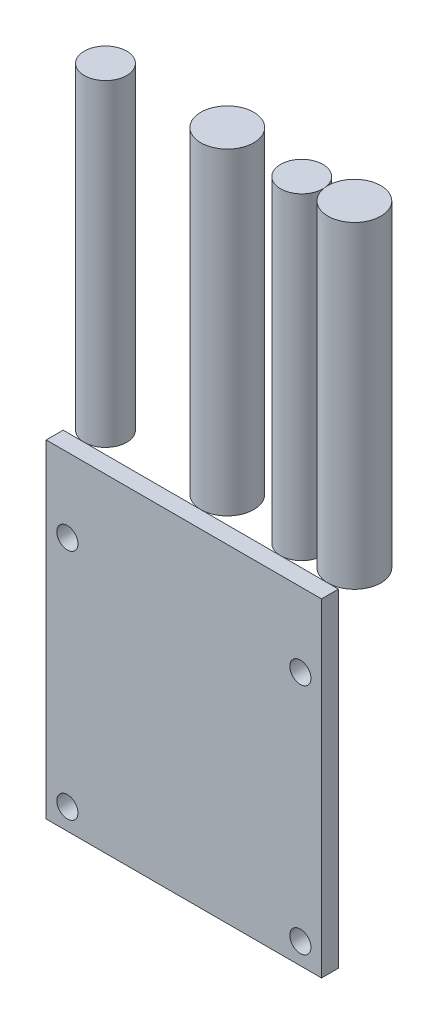
ISO-10303-21;
HEADER;
FILE_DESCRIPTION(('STEP AP214'),'2;1');
FILE_NAME('part.step','',(''),(''),'','','');
FILE_SCHEMA(('AUTOMOTIVE_DESIGN { 1 0 10303 214 1 1 1 1 }'));
ENDSEC;
DATA;
#1=APPLICATION_CONTEXT('core data for automotive mechanical design processes');
#2=APPLICATION_PROTOCOL_DEFINITION('international standard','automotive_design',2000,#1);
#3=PRODUCT_CONTEXT('',#1,'mechanical');
#4=PRODUCT('Part','Part','',(#3));
#5=PRODUCT_RELATED_PRODUCT_CATEGORY('part','',(#4));
#6=PRODUCT_DEFINITION_FORMATION('','',#4);
#7=PRODUCT_DEFINITION_CONTEXT('part definition',#1,'design');
#8=PRODUCT_DEFINITION('design','',#6,#7);
#9=PRODUCT_DEFINITION_SHAPE('','',#8);
#10=(LENGTH_UNIT() NAMED_UNIT(*) SI_UNIT(.MILLI.,.METRE.));
#11=(NAMED_UNIT(*) PLANE_ANGLE_UNIT() SI_UNIT($,.RADIAN.));
#12=(NAMED_UNIT(*) SI_UNIT($,.STERADIAN.) SOLID_ANGLE_UNIT());
#13=UNCERTAINTY_MEASURE_WITH_UNIT(LENGTH_MEASURE(1.E-05),#10,'distance_accuracy_value','');
#14=(GEOMETRIC_REPRESENTATION_CONTEXT(3) GLOBAL_UNCERTAINTY_ASSIGNED_CONTEXT((#13)) GLOBAL_UNIT_ASSIGNED_CONTEXT((#10,
#11,#12)) REPRESENTATION_CONTEXT('',''));
#15=CARTESIAN_POINT('',(0.,0.,0.));
#16=DIRECTION('',(0.,0.,1.));
#17=DIRECTION('',(1.,0.,0.));
#18=AXIS2_PLACEMENT_3D('',#15,#16,#17);
#19=CARTESIAN_POINT('',(12.,45.5,-3.3));
#20=DIRECTION('',(0.,-1.,0.));
#21=DIRECTION('',(0.,0.,-1.));
#22=AXIS2_PLACEMENT_3D('',#19,#20,#21);
#23=CYLINDRICAL_SURFACE('',#22,2.5);
#24=CARTESIAN_POINT('',(12.,45.5,-3.3));
#25=DIRECTION('',(0.,1.,0.));
#26=DIRECTION('',(0.,0.,1.));
#27=AXIS2_PLACEMENT_3D('',#24,#25,#26);
#28=CIRCLE('',#27,2.5);
#29=CARTESIAN_POINT('',(12.,45.5,-0.799999999999999));
#30=VERTEX_POINT('',#29);
#31=EDGE_CURVE('E12',#30,#30,#28,.T.);
#32=ORIENTED_EDGE('',*,*,#31,.F.);
#33=EDGE_LOOP('',(#32));
#34=FACE_BOUND('',#33,.T.);
#35=CARTESIAN_POINT('',(12.,15.5,-3.3));
#36=DIRECTION('',(0.,1.,0.));
#37=DIRECTION('',(0.,0.,1.));
#38=AXIS2_PLACEMENT_3D('',#35,#36,#37);
#39=CIRCLE('',#38,2.5);
#40=CARTESIAN_POINT('',(12.,15.5,-0.799999999999999));
#41=VERTEX_POINT('',#40);
#42=EDGE_CURVE('E53',#41,#41,#39,.T.);
#43=ORIENTED_EDGE('',*,*,#42,.T.);
#44=EDGE_LOOP('',(#43));
#45=FACE_BOUND('',#44,.T.);
#46=ADVANCED_FACE('F50',(#34,#45),#23,.T.);
#47=CARTESIAN_POINT('',(0.,45.5,0.));
#48=DIRECTION('',(0.,1.,0.));
#49=DIRECTION('',(0.,0.,1.));
#50=AXIS2_PLACEMENT_3D('',#47,#48,#49);
#51=PLANE('',#50);
#52=ORIENTED_EDGE('',*,*,#31,.T.);
#53=EDGE_LOOP('',(#52));
#54=FACE_BOUND('',#53,.T.);
#55=ADVANCED_FACE('F65',(#54),#51,.T.);
#56=CARTESIAN_POINT('',(0.,15.5,0.));
#57=DIRECTION('',(0.,1.,0.));
#58=DIRECTION('',(0.,0.,1.));
#59=AXIS2_PLACEMENT_3D('',#56,#57,#58);
#60=PLANE('',#59);
#61=ORIENTED_EDGE('',*,*,#42,.F.);
#62=EDGE_LOOP('',(#61));
#63=FACE_BOUND('',#62,.T.);
#64=ADVANCED_FACE('F63',(#63),#60,.F.);
#65=CLOSED_SHELL('',(#46,#55,#64));
#66=MANIFOLD_SOLID_BREP('B2',#65);
#67=CARTESIAN_POINT('',(7.52786404500042,45.5,-2.8));
#68=DIRECTION('',(0.,-1.,0.));
#69=DIRECTION('',(0.,0.,-1.));
#70=AXIS2_PLACEMENT_3D('',#67,#68,#69);
#71=CYLINDRICAL_SURFACE('',#70,2.);
#72=CARTESIAN_POINT('',(7.52786404500042,45.5,-2.8));
#73=DIRECTION('',(0.,1.,0.));
#74=DIRECTION('',(0.,0.,1.));
#75=AXIS2_PLACEMENT_3D('',#72,#73,#74);
#76=CIRCLE('',#75,2.);
#77=CARTESIAN_POINT('',(7.52786404500042,45.5,-0.8));
#78=VERTEX_POINT('',#77);
#79=EDGE_CURVE('E49',#78,#78,#76,.T.);
#80=ORIENTED_EDGE('',*,*,#79,.F.);
#81=EDGE_LOOP('',(#80));
#82=FACE_BOUND('',#81,.T.);
#83=CARTESIAN_POINT('',(7.52786404500042,15.5,-2.8));
#84=DIRECTION('',(0.,1.,0.));
#85=DIRECTION('',(0.,0.,1.));
#86=AXIS2_PLACEMENT_3D('',#83,#84,#85);
#87=CIRCLE('',#86,2.);
#88=CARTESIAN_POINT('',(7.52786404500042,15.5,-0.8));
#89=VERTEX_POINT('',#88);
#90=EDGE_CURVE('E102',#89,#89,#87,.T.);
#91=ORIENTED_EDGE('',*,*,#90,.T.);
#92=EDGE_LOOP('',(#91));
#93=FACE_BOUND('',#92,.T.);
#94=ADVANCED_FACE('F99',(#82,#93),#71,.T.);
#95=CARTESIAN_POINT('',(0.,45.5,0.));
#96=DIRECTION('',(0.,1.,0.));
#97=DIRECTION('',(0.,0.,1.));
#98=AXIS2_PLACEMENT_3D('',#95,#96,#97);
#99=PLANE('',#98);
#100=ORIENTED_EDGE('',*,*,#79,.T.);
#101=EDGE_LOOP('',(#100));
#102=FACE_BOUND('',#101,.T.);
#103=ADVANCED_FACE('F114',(#102),#99,.T.);
#104=CARTESIAN_POINT('',(0.,15.5,0.));
#105=DIRECTION('',(0.,1.,0.));
#106=DIRECTION('',(0.,0.,1.));
#107=AXIS2_PLACEMENT_3D('',#104,#105,#106);
#108=PLANE('',#107);
#109=ORIENTED_EDGE('',*,*,#90,.F.);
#110=EDGE_LOOP('',(#109));
#111=FACE_BOUND('',#110,.T.);
#112=ADVANCED_FACE('F112',(#111),#108,.F.);
#113=CLOSED_SHELL('',(#94,#103,#112));
#114=MANIFOLD_SOLID_BREP('B7',#113);
#115=CARTESIAN_POINT('',(0.,45.5,-3.3));
#116=DIRECTION('',(0.,-1.,0.));
#117=DIRECTION('',(0.,0.,-1.));
#118=AXIS2_PLACEMENT_3D('',#115,#116,#117);
#119=CYLINDRICAL_SURFACE('',#118,2.5);
#120=CARTESIAN_POINT('',(0.,45.5,-3.3));
#121=DIRECTION('',(0.,1.,0.));
#122=DIRECTION('',(0.,0.,1.));
#123=AXIS2_PLACEMENT_3D('',#120,#121,#122);
#124=CIRCLE('',#123,2.5);
#125=CARTESIAN_POINT('',(0.,45.5,-0.799999999999999));
#126=VERTEX_POINT('',#125);
#127=EDGE_CURVE('E98',#126,#126,#124,.T.);
#128=ORIENTED_EDGE('',*,*,#127,.F.);
#129=EDGE_LOOP('',(#128));
#130=FACE_BOUND('',#129,.T.);
#131=CARTESIAN_POINT('',(0.,15.5,-3.3));
#132=DIRECTION('',(0.,1.,0.));
#133=DIRECTION('',(0.,0.,1.));
#134=AXIS2_PLACEMENT_3D('',#131,#132,#133);
#135=CIRCLE('',#134,2.5);
#136=CARTESIAN_POINT('',(0.,15.5,-0.799999999999999));
#137=VERTEX_POINT('',#136);
#138=EDGE_CURVE('E151',#137,#137,#135,.T.);
#139=ORIENTED_EDGE('',*,*,#138,.T.);
#140=EDGE_LOOP('',(#139));
#141=FACE_BOUND('',#140,.T.);
#142=ADVANCED_FACE('F148',(#130,#141),#119,.T.);
#143=CARTESIAN_POINT('',(0.,45.5,0.));
#144=DIRECTION('',(0.,1.,0.));
#145=DIRECTION('',(0.,0.,1.));
#146=AXIS2_PLACEMENT_3D('',#143,#144,#145);
#147=PLANE('',#146);
#148=ORIENTED_EDGE('',*,*,#127,.T.);
#149=EDGE_LOOP('',(#148));
#150=FACE_BOUND('',#149,.T.);
#151=ADVANCED_FACE('F163',(#150),#147,.T.);
#152=CARTESIAN_POINT('',(0.,15.5,0.));
#153=DIRECTION('',(0.,1.,0.));
#154=DIRECTION('',(0.,0.,1.));
#155=AXIS2_PLACEMENT_3D('',#152,#153,#154);
#156=PLANE('',#155);
#157=ORIENTED_EDGE('',*,*,#138,.F.);
#158=EDGE_LOOP('',(#157));
#159=FACE_BOUND('',#158,.T.);
#160=ADVANCED_FACE('F161',(#159),#156,.F.);
#161=CLOSED_SHELL('',(#142,#151,#160));
#162=MANIFOLD_SOLID_BREP('B44',#161);
#163=CARTESIAN_POINT('',(-11.,45.5,-2.8));
#164=DIRECTION('',(0.,-1.,0.));
#165=DIRECTION('',(0.,0.,-1.));
#166=AXIS2_PLACEMENT_3D('',#163,#164,#165);
#167=CYLINDRICAL_SURFACE('',#166,2.);
#168=CARTESIAN_POINT('',(-11.,45.5,-2.8));
#169=DIRECTION('',(0.,1.,0.));
#170=DIRECTION('',(0.,0.,1.));
#171=AXIS2_PLACEMENT_3D('',#168,#169,#170);
#172=CIRCLE('',#171,2.);
#173=CARTESIAN_POINT('',(-11.,45.5,-0.8));
#174=VERTEX_POINT('',#173);
#175=EDGE_CURVE('E147',#174,#174,#172,.T.);
#176=ORIENTED_EDGE('',*,*,#175,.F.);
#177=EDGE_LOOP('',(#176));
#178=FACE_BOUND('',#177,.T.);
#179=CARTESIAN_POINT('',(-11.,15.5,-2.8));
#180=DIRECTION('',(0.,1.,0.));
#181=DIRECTION('',(0.,0.,1.));
#182=AXIS2_PLACEMENT_3D('',#179,#180,#181);
#183=CIRCLE('',#182,2.);
#184=CARTESIAN_POINT('',(-11.,15.5,-0.8));
#185=VERTEX_POINT('',#184);
#186=EDGE_CURVE('E201',#185,#185,#183,.T.);
#187=ORIENTED_EDGE('',*,*,#186,.T.);
#188=EDGE_LOOP('',(#187));
#189=FACE_BOUND('',#188,.T.);
#190=ADVANCED_FACE('F198',(#178,#189),#167,.T.);
#191=CARTESIAN_POINT('',(0.,45.5,0.));
#192=DIRECTION('',(0.,1.,0.));
#193=DIRECTION('',(0.,0.,1.));
#194=AXIS2_PLACEMENT_3D('',#191,#192,#193);
#195=PLANE('',#194);
#196=ORIENTED_EDGE('',*,*,#175,.T.);
#197=EDGE_LOOP('',(#196));
#198=FACE_BOUND('',#197,.T.);
#199=ADVANCED_FACE('F213',(#198),#195,.T.);
#200=CARTESIAN_POINT('',(0.,15.5,0.));
#201=DIRECTION('',(0.,1.,0.));
#202=DIRECTION('',(0.,0.,1.));
#203=AXIS2_PLACEMENT_3D('',#200,#201,#202);
#204=PLANE('',#203);
#205=ORIENTED_EDGE('',*,*,#186,.F.);
#206=EDGE_LOOP('',(#205));
#207=FACE_BOUND('',#206,.T.);
#208=ADVANCED_FACE('F211',(#207),#204,.F.);
#209=CLOSED_SHELL('',(#190,#199,#208));
#210=MANIFOLD_SOLID_BREP('B93',#209);
#211=CARTESIAN_POINT('',(0.,0.,0.8));
#212=DIRECTION('',(0.,0.,-1.));
#213=DIRECTION('',(-1.,0.,0.));
#214=AXIS2_PLACEMENT_3D('',#211,#212,#213);
#215=PLANE('',#214);
#216=DIRECTION('',(0.,1.,0.));
#217=VECTOR('',#216,1.);
#218=CARTESIAN_POINT('',(13.,-15.5,0.8));
#219=LINE('',#218,#217);
#220=CARTESIAN_POINT('',(13.,-15.5,0.8));
#221=VERTEX_POINT('',#220);
#222=CARTESIAN_POINT('',(13.,15.5,0.8));
#223=VERTEX_POINT('',#222);
#224=EDGE_CURVE('E291',#221,#223,#219,.T.);
#225=ORIENTED_EDGE('',*,*,#224,.T.);
#226=DIRECTION('',(-1.,0.,0.));
#227=VECTOR('',#226,1.);
#228=CARTESIAN_POINT('',(-13.,15.5,0.8));
#229=LINE('',#228,#227);
#230=CARTESIAN_POINT('',(-13.,15.5,0.8));
#231=VERTEX_POINT('',#230);
#232=EDGE_CURVE('E286',#223,#231,#229,.T.);
#233=ORIENTED_EDGE('',*,*,#232,.T.);
#234=DIRECTION('',(0.,-1.,0.));
#235=VECTOR('',#234,1.);
#236=CARTESIAN_POINT('',(-13.,-15.5,0.8));
#237=LINE('',#236,#235);
#238=CARTESIAN_POINT('',(-13.,-15.5,0.8));
#239=VERTEX_POINT('',#238);
#240=EDGE_CURVE('E289',#231,#239,#237,.T.);
#241=ORIENTED_EDGE('',*,*,#240,.T.);
#242=DIRECTION('',(1.,0.,0.));
#243=VECTOR('',#242,1.);
#244=CARTESIAN_POINT('',(-13.,-15.5,0.8));
#245=LINE('',#244,#243);
#246=EDGE_CURVE('E256',#239,#221,#245,.T.);
#247=ORIENTED_EDGE('',*,*,#246,.T.);
#248=EDGE_LOOP('',(#225,#233,#241,#247));
#249=FACE_BOUND('',#248,.T.);
#250=CARTESIAN_POINT('',(-11.,-13.5,0.8));
#251=DIRECTION('',(0.,0.,1.));
#252=DIRECTION('',(1.,0.,0.));
#253=AXIS2_PLACEMENT_3D('',#250,#251,#252);
#254=CIRCLE('',#253,0.999999999999998);
#255=CARTESIAN_POINT('',(-10.,-13.5,0.8));
#256=VERTEX_POINT('',#255);
#257=EDGE_CURVE('E306',#256,#256,#254,.T.);
#258=ORIENTED_EDGE('',*,*,#257,.F.);
#259=EDGE_LOOP('',(#258));
#260=FACE_BOUND('',#259,.T.);
#261=CARTESIAN_POINT('',(11.,-13.5,0.8));
#262=DIRECTION('',(0.,0.,1.));
#263=DIRECTION('',(-1.,0.,0.));
#264=AXIS2_PLACEMENT_3D('',#261,#262,#263);
#265=CIRCLE('',#264,0.999999999999998);
#266=CARTESIAN_POINT('',(10.,-13.5,0.8));
#267=VERTEX_POINT('',#266);
#268=EDGE_CURVE('E321',#267,#267,#265,.T.);
#269=ORIENTED_EDGE('',*,*,#268,.F.);
#270=EDGE_LOOP('',(#269));
#271=FACE_BOUND('',#270,.T.);
#272=CARTESIAN_POINT('',(11.,8.5,0.8));
#273=DIRECTION('',(0.,0.,1.));
#274=DIRECTION('',(1.,0.,0.));
#275=AXIS2_PLACEMENT_3D('',#272,#273,#274);
#276=CIRCLE('',#275,1.);
#277=CARTESIAN_POINT('',(12.,8.5,0.8));
#278=VERTEX_POINT('',#277);
#279=EDGE_CURVE('E327',#278,#278,#276,.T.);
#280=ORIENTED_EDGE('',*,*,#279,.F.);
#281=EDGE_LOOP('',(#280));
#282=FACE_BOUND('',#281,.T.);
#283=CARTESIAN_POINT('',(-11.,8.5,0.8));
#284=DIRECTION('',(0.,0.,1.));
#285=DIRECTION('',(-1.,0.,0.));
#286=AXIS2_PLACEMENT_3D('',#283,#284,#285);
#287=CIRCLE('',#286,1.);
#288=CARTESIAN_POINT('',(-12.,8.5,0.8));
#289=VERTEX_POINT('',#288);
#290=EDGE_CURVE('E333',#289,#289,#287,.T.);
#291=ORIENTED_EDGE('',*,*,#290,.F.);
#292=EDGE_LOOP('',(#291));
#293=FACE_BOUND('',#292,.T.);
#294=ADVANCED_FACE('F239',(#249,#260,#271,#282,#293),#215,.F.);
#295=CARTESIAN_POINT('',(0.,0.,-0.8));
#296=DIRECTION('',(0.,0.,-1.));
#297=DIRECTION('',(-1.,0.,0.));
#298=AXIS2_PLACEMENT_3D('',#295,#296,#297);
#299=PLANE('',#298);
#300=CARTESIAN_POINT('',(11.,8.5,-0.8));
#301=DIRECTION('',(0.,0.,1.));
#302=DIRECTION('',(1.,0.,0.));
#303=AXIS2_PLACEMENT_3D('',#300,#301,#302);
#304=CIRCLE('',#303,1.);
#305=CARTESIAN_POINT('',(12.,8.5,-0.8));
#306=VERTEX_POINT('',#305);
#307=EDGE_CURVE('E330',#306,#306,#304,.T.);
#308=ORIENTED_EDGE('',*,*,#307,.T.);
#309=EDGE_LOOP('',(#308));
#310=FACE_BOUND('',#309,.T.);
#311=CARTESIAN_POINT('',(-11.,-13.5,-0.8));
#312=DIRECTION('',(0.,0.,1.));
#313=DIRECTION('',(1.,0.,0.));
#314=AXIS2_PLACEMENT_3D('',#311,#312,#313);
#315=CIRCLE('',#314,0.999999999999998);
#316=CARTESIAN_POINT('',(-10.,-13.5,-0.8));
#317=VERTEX_POINT('',#316);
#318=EDGE_CURVE('E318',#317,#317,#315,.T.);
#319=ORIENTED_EDGE('',*,*,#318,.T.);
#320=EDGE_LOOP('',(#319));
#321=FACE_BOUND('',#320,.T.);
#322=DIRECTION('',(0.,1.,0.));
#323=VECTOR('',#322,1.);
#324=CARTESIAN_POINT('',(13.,-15.5,-0.8));
#325=LINE('',#324,#323);
#326=CARTESIAN_POINT('',(13.,-15.5,-0.8));
#327=VERTEX_POINT('',#326);
#328=CARTESIAN_POINT('',(13.,15.5,-0.8));
#329=VERTEX_POINT('',#328);
#330=EDGE_CURVE('E303',#327,#329,#325,.T.);
#331=ORIENTED_EDGE('',*,*,#330,.F.);
#332=DIRECTION('',(1.,0.,0.));
#333=VECTOR('',#332,1.);
#334=CARTESIAN_POINT('',(-13.,-15.5,-0.8));
#335=LINE('',#334,#333);
#336=CARTESIAN_POINT('',(-13.,-15.5,-0.8));
#337=VERTEX_POINT('',#336);
#338=EDGE_CURVE('E279',#337,#327,#335,.T.);
#339=ORIENTED_EDGE('',*,*,#338,.F.);
#340=DIRECTION('',(0.,-1.,0.));
#341=VECTOR('',#340,1.);
#342=CARTESIAN_POINT('',(-13.,-15.5,-0.8));
#343=LINE('',#342,#341);
#344=CARTESIAN_POINT('',(-13.,15.5,-0.8));
#345=VERTEX_POINT('',#344);
#346=EDGE_CURVE('E273',#345,#337,#343,.T.);
#347=ORIENTED_EDGE('',*,*,#346,.F.);
#348=DIRECTION('',(-1.,0.,0.));
#349=VECTOR('',#348,1.);
#350=CARTESIAN_POINT('',(-13.,15.5,-0.8));
#351=LINE('',#350,#349);
#352=EDGE_CURVE('E295',#329,#345,#351,.T.);
#353=ORIENTED_EDGE('',*,*,#352,.F.);
#354=EDGE_LOOP('',(#331,#339,#347,#353));
#355=FACE_BOUND('',#354,.T.);
#356=CARTESIAN_POINT('',(11.,-13.5,-0.8));
#357=DIRECTION('',(0.,0.,1.));
#358=DIRECTION('',(-1.,0.,0.));
#359=AXIS2_PLACEMENT_3D('',#356,#357,#358);
#360=CIRCLE('',#359,0.999999999999998);
#361=CARTESIAN_POINT('',(10.,-13.5,-0.8));
#362=VERTEX_POINT('',#361);
#363=EDGE_CURVE('E324',#362,#362,#360,.T.);
#364=ORIENTED_EDGE('',*,*,#363,.T.);
#365=EDGE_LOOP('',(#364));
#366=FACE_BOUND('',#365,.T.);
#367=CARTESIAN_POINT('',(-11.,8.5,-0.8));
#368=DIRECTION('',(0.,0.,1.));
#369=DIRECTION('',(-1.,0.,0.));
#370=AXIS2_PLACEMENT_3D('',#367,#368,#369);
#371=CIRCLE('',#370,1.);
#372=CARTESIAN_POINT('',(-12.,8.5,-0.8));
#373=VERTEX_POINT('',#372);
#374=EDGE_CURVE('E336',#373,#373,#371,.T.);
#375=ORIENTED_EDGE('',*,*,#374,.T.);
#376=EDGE_LOOP('',(#375));
#377=FACE_BOUND('',#376,.T.);
#378=ADVANCED_FACE('F314',(#310,#321,#355,#366,#377),#299,.T.);
#379=CARTESIAN_POINT('',(13.,-15.5,0.8));
#380=DIRECTION('',(-1.,0.,0.));
#381=DIRECTION('',(0.,0.,1.));
#382=AXIS2_PLACEMENT_3D('',#379,#380,#381);
#383=PLANE('',#382);
#384=ORIENTED_EDGE('',*,*,#330,.T.);
#385=DIRECTION('',(0.,0.,-1.));
#386=VECTOR('',#385,1.);
#387=CARTESIAN_POINT('',(13.,15.5,0.8));
#388=LINE('',#387,#386);
#389=EDGE_CURVE('E196',#223,#329,#388,.T.);
#390=ORIENTED_EDGE('',*,*,#389,.F.);
#391=ORIENTED_EDGE('',*,*,#224,.F.);
#392=DIRECTION('',(0.,0.,-1.));
#393=VECTOR('',#392,1.);
#394=CARTESIAN_POINT('',(13.,-15.5,0.8));
#395=LINE('',#394,#393);
#396=EDGE_CURVE('E299',#221,#327,#395,.T.);
#397=ORIENTED_EDGE('',*,*,#396,.T.);
#398=EDGE_LOOP('',(#384,#390,#391,#397));
#399=FACE_BOUND('',#398,.T.);
#400=ADVANCED_FACE('F241',(#399),#383,.F.);
#401=CARTESIAN_POINT('',(-13.,15.5,0.8));
#402=DIRECTION('',(0.,-1.,0.));
#403=DIRECTION('',(0.,0.,-1.));
#404=AXIS2_PLACEMENT_3D('',#401,#402,#403);
#405=PLANE('',#404);
#406=ORIENTED_EDGE('',*,*,#352,.T.);
#407=DIRECTION('',(0.,0.,-1.));
#408=VECTOR('',#407,1.);
#409=CARTESIAN_POINT('',(-13.,15.5,0.8));
#410=LINE('',#409,#408);
#411=EDGE_CURVE('E248',#231,#345,#410,.T.);
#412=ORIENTED_EDGE('',*,*,#411,.F.);
#413=ORIENTED_EDGE('',*,*,#232,.F.);
#414=ORIENTED_EDGE('',*,*,#389,.T.);
#415=EDGE_LOOP('',(#406,#412,#413,#414));
#416=FACE_BOUND('',#415,.T.);
#417=ADVANCED_FACE('F294',(#416),#405,.F.);
#418=CARTESIAN_POINT('',(-13.,-15.5,0.8));
#419=DIRECTION('',(1.,0.,0.));
#420=DIRECTION('',(0.,0.,-1.));
#421=AXIS2_PLACEMENT_3D('',#418,#419,#420);
#422=PLANE('',#421);
#423=ORIENTED_EDGE('',*,*,#346,.T.);
#424=DIRECTION('',(0.,0.,-1.));
#425=VECTOR('',#424,1.);
#426=CARTESIAN_POINT('',(-13.,-15.5,0.8));
#427=LINE('',#426,#425);
#428=EDGE_CURVE('E296',#239,#337,#427,.T.);
#429=ORIENTED_EDGE('',*,*,#428,.F.);
#430=ORIENTED_EDGE('',*,*,#240,.F.);
#431=ORIENTED_EDGE('',*,*,#411,.T.);
#432=EDGE_LOOP('',(#423,#429,#430,#431));
#433=FACE_BOUND('',#432,.T.);
#434=ADVANCED_FACE('F297',(#433),#422,.F.);
#435=CARTESIAN_POINT('',(-13.,-15.5,0.8));
#436=DIRECTION('',(0.,1.,0.));
#437=DIRECTION('',(0.,0.,1.));
#438=AXIS2_PLACEMENT_3D('',#435,#436,#437);
#439=PLANE('',#438);
#440=ORIENTED_EDGE('',*,*,#338,.T.);
#441=ORIENTED_EDGE('',*,*,#396,.F.);
#442=ORIENTED_EDGE('',*,*,#246,.F.);
#443=ORIENTED_EDGE('',*,*,#428,.T.);
#444=EDGE_LOOP('',(#440,#441,#442,#443));
#445=FACE_BOUND('',#444,.T.);
#446=ADVANCED_FACE('F311',(#445),#439,.F.);
#447=CARTESIAN_POINT('',(-11.,-13.5,0.8));
#448=DIRECTION('',(0.,0.,-1.));
#449=DIRECTION('',(-1.,0.,0.));
#450=AXIS2_PLACEMENT_3D('',#447,#448,#449);
#451=CYLINDRICAL_SURFACE('',#450,0.999999999999998);
#452=ORIENTED_EDGE('',*,*,#257,.T.);
#453=EDGE_LOOP('',(#452));
#454=FACE_BOUND('',#453,.T.);
#455=ORIENTED_EDGE('',*,*,#318,.F.);
#456=EDGE_LOOP('',(#455));
#457=FACE_BOUND('',#456,.T.);
#458=ADVANCED_FACE('F353',(#454,#457),#451,.F.);
#459=CARTESIAN_POINT('',(11.,-13.5,0.8));
#460=DIRECTION('',(0.,0.,-1.));
#461=DIRECTION('',(-1.,0.,0.));
#462=AXIS2_PLACEMENT_3D('',#459,#460,#461);
#463=CYLINDRICAL_SURFACE('',#462,0.999999999999998);
#464=ORIENTED_EDGE('',*,*,#268,.T.);
#465=EDGE_LOOP('',(#464));
#466=FACE_BOUND('',#465,.T.);
#467=ORIENTED_EDGE('',*,*,#363,.F.);
#468=EDGE_LOOP('',(#467));
#469=FACE_BOUND('',#468,.T.);
#470=ADVANCED_FACE('F399',(#466,#469),#463,.F.);
#471=CARTESIAN_POINT('',(11.,8.5,0.8));
#472=DIRECTION('',(0.,0.,-1.));
#473=DIRECTION('',(-1.,0.,0.));
#474=AXIS2_PLACEMENT_3D('',#471,#472,#473);
#475=CYLINDRICAL_SURFACE('',#474,1.);
#476=ORIENTED_EDGE('',*,*,#279,.T.);
#477=EDGE_LOOP('',(#476));
#478=FACE_BOUND('',#477,.T.);
#479=ORIENTED_EDGE('',*,*,#307,.F.);
#480=EDGE_LOOP('',(#479));
#481=FACE_BOUND('',#480,.T.);
#482=ADVANCED_FACE('F407',(#478,#481),#475,.F.);
#483=CARTESIAN_POINT('',(-11.,8.5,0.8));
#484=DIRECTION('',(0.,0.,-1.));
#485=DIRECTION('',(-1.,0.,0.));
#486=AXIS2_PLACEMENT_3D('',#483,#484,#485);
#487=CYLINDRICAL_SURFACE('',#486,1.);
#488=ORIENTED_EDGE('',*,*,#290,.T.);
#489=EDGE_LOOP('',(#488));
#490=FACE_BOUND('',#489,.T.);
#491=ORIENTED_EDGE('',*,*,#374,.F.);
#492=EDGE_LOOP('',(#491));
#493=FACE_BOUND('',#492,.T.);
#494=ADVANCED_FACE('F342',(#490,#493),#487,.F.);
#495=CLOSED_SHELL('',(#294,#378,#400,#417,#434,#446,#458,#470,#482,#494));
#496=MANIFOLD_SOLID_BREP('B142',#495);
#497=ADVANCED_BREP_SHAPE_REPRESENTATION('',(#18,#66,#114,#162,#210,#496),#14);
#498=SHAPE_DEFINITION_REPRESENTATION(#9,#497);
ENDSEC;
END-ISO-10303-21;
